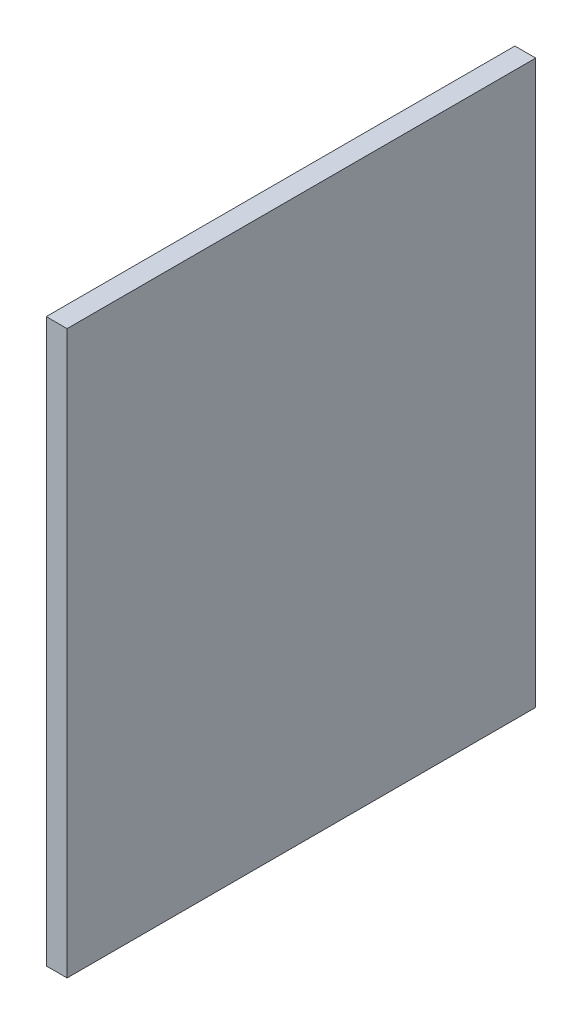
ISO-10303-21;
HEADER;
FILE_DESCRIPTION(('STEP AP214'),'2;1');
FILE_NAME('part.step','',(''),(''),'','','');
FILE_SCHEMA(('AUTOMOTIVE_DESIGN { 1 0 10303 214 1 1 1 1 }'));
ENDSEC;
DATA;
#1=APPLICATION_CONTEXT('core data for automotive mechanical design processes');
#2=APPLICATION_PROTOCOL_DEFINITION('international standard','automotive_design',2000,#1);
#3=PRODUCT_CONTEXT('',#1,'mechanical');
#4=PRODUCT('Part','Part','',(#3));
#5=PRODUCT_RELATED_PRODUCT_CATEGORY('part','',(#4));
#6=PRODUCT_DEFINITION_FORMATION('','',#4);
#7=PRODUCT_DEFINITION_CONTEXT('part definition',#1,'design');
#8=PRODUCT_DEFINITION('design','',#6,#7);
#9=PRODUCT_DEFINITION_SHAPE('','',#8);
#10=(LENGTH_UNIT() NAMED_UNIT(*) SI_UNIT(.MILLI.,.METRE.));
#11=(NAMED_UNIT(*) PLANE_ANGLE_UNIT() SI_UNIT($,.RADIAN.));
#12=(NAMED_UNIT(*) SI_UNIT($,.STERADIAN.) SOLID_ANGLE_UNIT());
#13=UNCERTAINTY_MEASURE_WITH_UNIT(LENGTH_MEASURE(1.E-05),#10,'distance_accuracy_value','');
#14=(GEOMETRIC_REPRESENTATION_CONTEXT(3) GLOBAL_UNCERTAINTY_ASSIGNED_CONTEXT((#13)) GLOBAL_UNIT_ASSIGNED_CONTEXT((#10,
#11,#12)) REPRESENTATION_CONTEXT('',''));
#15=CARTESIAN_POINT('',(0.,0.,0.));
#16=DIRECTION('',(0.,0.,1.));
#17=DIRECTION('',(1.,0.,0.));
#18=AXIS2_PLACEMENT_3D('',#15,#16,#17);
#19=CARTESIAN_POINT('',(6.,81.,-67.5));
#20=DIRECTION('',(0.,0.,1.));
#21=DIRECTION('',(0.,-1.,0.));
#22=AXIS2_PLACEMENT_3D('',#19,#20,#21);
#23=PLANE('',#22);
#24=DIRECTION('',(0.,1.,0.));
#25=VECTOR('',#24,1.);
#26=CARTESIAN_POINT('',(0.,81.,-67.5));
#27=LINE('',#26,#25);
#28=CARTESIAN_POINT('',(0.,-81.,-67.5));
#29=VERTEX_POINT('',#28);
#30=CARTESIAN_POINT('',(0.,81.,-67.5));
#31=VERTEX_POINT('',#30);
#32=EDGE_CURVE('E96',#29,#31,#27,.T.);
#33=ORIENTED_EDGE('',*,*,#32,.T.);
#34=DIRECTION('',(-1.,0.,0.));
#35=VECTOR('',#34,1.);
#36=CARTESIAN_POINT('',(6.,81.,-67.5));
#37=LINE('',#36,#35);
#38=CARTESIAN_POINT('',(6.,81.,-67.5));
#39=VERTEX_POINT('',#38);
#40=EDGE_CURVE('E11',#39,#31,#37,.T.);
#41=ORIENTED_EDGE('',*,*,#40,.F.);
#42=DIRECTION('',(0.,1.,0.));
#43=VECTOR('',#42,1.);
#44=CARTESIAN_POINT('',(6.,81.,-67.5));
#45=LINE('',#44,#43);
#46=CARTESIAN_POINT('',(6.,-81.,-67.5));
#47=VERTEX_POINT('',#46);
#48=EDGE_CURVE('E84',#47,#39,#45,.T.);
#49=ORIENTED_EDGE('',*,*,#48,.F.);
#50=DIRECTION('',(-1.,0.,0.));
#51=VECTOR('',#50,1.);
#52=CARTESIAN_POINT('',(6.,-81.,-67.5));
#53=LINE('',#52,#51);
#54=EDGE_CURVE('E92',#47,#29,#53,.T.);
#55=ORIENTED_EDGE('',*,*,#54,.T.);
#56=EDGE_LOOP('',(#33,#41,#49,#55));
#57=FACE_BOUND('',#56,.T.);
#58=ADVANCED_FACE('F33',(#57),#23,.F.);
#59=CARTESIAN_POINT('',(6.,81.,67.5));
#60=DIRECTION('',(0.,-1.,0.));
#61=DIRECTION('',(0.,0.,-1.));
#62=AXIS2_PLACEMENT_3D('',#59,#60,#61);
#63=PLANE('',#62);
#64=DIRECTION('',(0.,0.,1.));
#65=VECTOR('',#64,1.);
#66=CARTESIAN_POINT('',(0.,81.,67.5));
#67=LINE('',#66,#65);
#68=CARTESIAN_POINT('',(0.,81.,67.5));
#69=VERTEX_POINT('',#68);
#70=EDGE_CURVE('E88',#31,#69,#67,.T.);
#71=ORIENTED_EDGE('',*,*,#70,.T.);
#72=DIRECTION('',(-1.,0.,0.));
#73=VECTOR('',#72,1.);
#74=CARTESIAN_POINT('',(6.,81.,67.5));
#75=LINE('',#74,#73);
#76=CARTESIAN_POINT('',(6.,81.,67.5));
#77=VERTEX_POINT('',#76);
#78=EDGE_CURVE('E41',#77,#69,#75,.T.);
#79=ORIENTED_EDGE('',*,*,#78,.F.);
#80=DIRECTION('',(0.,0.,1.));
#81=VECTOR('',#80,1.);
#82=CARTESIAN_POINT('',(6.,81.,67.5));
#83=LINE('',#82,#81);
#84=EDGE_CURVE('E79',#39,#77,#83,.T.);
#85=ORIENTED_EDGE('',*,*,#84,.F.);
#86=ORIENTED_EDGE('',*,*,#40,.T.);
#87=EDGE_LOOP('',(#71,#79,#85,#86));
#88=FACE_BOUND('',#87,.T.);
#89=ADVANCED_FACE('F87',(#88),#63,.F.);
#90=CARTESIAN_POINT('',(6.,81.,67.5));
#91=DIRECTION('',(0.,0.,-1.));
#92=DIRECTION('',(-1.,0.,0.));
#93=AXIS2_PLACEMENT_3D('',#90,#91,#92);
#94=PLANE('',#93);
#95=DIRECTION('',(0.,-1.,0.));
#96=VECTOR('',#95,1.);
#97=CARTESIAN_POINT('',(0.,81.,67.5));
#98=LINE('',#97,#96);
#99=CARTESIAN_POINT('',(0.,-81.,67.5));
#100=VERTEX_POINT('',#99);
#101=EDGE_CURVE('E66',#69,#100,#98,.T.);
#102=ORIENTED_EDGE('',*,*,#101,.T.);
#103=DIRECTION('',(-1.,0.,0.));
#104=VECTOR('',#103,1.);
#105=CARTESIAN_POINT('',(6.,-81.,67.5));
#106=LINE('',#105,#104);
#107=CARTESIAN_POINT('',(6.,-81.,67.5));
#108=VERTEX_POINT('',#107);
#109=EDGE_CURVE('E89',#108,#100,#106,.T.);
#110=ORIENTED_EDGE('',*,*,#109,.F.);
#111=DIRECTION('',(0.,-1.,0.));
#112=VECTOR('',#111,1.);
#113=CARTESIAN_POINT('',(6.,81.,67.5));
#114=LINE('',#113,#112);
#115=EDGE_CURVE('E82',#77,#108,#114,.T.);
#116=ORIENTED_EDGE('',*,*,#115,.F.);
#117=ORIENTED_EDGE('',*,*,#78,.T.);
#118=EDGE_LOOP('',(#102,#110,#116,#117));
#119=FACE_BOUND('',#118,.T.);
#120=ADVANCED_FACE('F90',(#119),#94,.F.);
#121=CARTESIAN_POINT('',(6.,-81.,67.5));
#122=DIRECTION('',(0.,1.,0.));
#123=DIRECTION('',(0.,0.,1.));
#124=AXIS2_PLACEMENT_3D('',#121,#122,#123);
#125=PLANE('',#124);
#126=DIRECTION('',(0.,0.,-1.));
#127=VECTOR('',#126,1.);
#128=CARTESIAN_POINT('',(0.,-81.,67.5));
#129=LINE('',#128,#127);
#130=EDGE_CURVE('E72',#100,#29,#129,.T.);
#131=ORIENTED_EDGE('',*,*,#130,.T.);
#132=ORIENTED_EDGE('',*,*,#54,.F.);
#133=DIRECTION('',(0.,0.,-1.));
#134=VECTOR('',#133,1.);
#135=CARTESIAN_POINT('',(6.,-81.,67.5));
#136=LINE('',#135,#134);
#137=EDGE_CURVE('E49',#108,#47,#136,.T.);
#138=ORIENTED_EDGE('',*,*,#137,.F.);
#139=ORIENTED_EDGE('',*,*,#109,.T.);
#140=EDGE_LOOP('',(#131,#132,#138,#139));
#141=FACE_BOUND('',#140,.T.);
#142=ADVANCED_FACE('F103',(#141),#125,.F.);
#143=CARTESIAN_POINT('',(6.,0.,0.));
#144=DIRECTION('',(1.,0.,0.));
#145=DIRECTION('',(0.,0.,-1.));
#146=AXIS2_PLACEMENT_3D('',#143,#144,#145);
#147=PLANE('',#146);
#148=ORIENTED_EDGE('',*,*,#48,.T.);
#149=ORIENTED_EDGE('',*,*,#84,.T.);
#150=ORIENTED_EDGE('',*,*,#115,.T.);
#151=ORIENTED_EDGE('',*,*,#137,.T.);
#152=EDGE_LOOP('',(#148,#149,#150,#151));
#153=FACE_BOUND('',#152,.T.);
#154=ADVANCED_FACE('F80',(#153),#147,.T.);
#155=CARTESIAN_POINT('',(0.,0.,0.));
#156=DIRECTION('',(1.,0.,0.));
#157=DIRECTION('',(0.,0.,-1.));
#158=AXIS2_PLACEMENT_3D('',#155,#156,#157);
#159=PLANE('',#158);
#160=ORIENTED_EDGE('',*,*,#32,.F.);
#161=ORIENTED_EDGE('',*,*,#130,.F.);
#162=ORIENTED_EDGE('',*,*,#101,.F.);
#163=ORIENTED_EDGE('',*,*,#70,.F.);
#164=EDGE_LOOP('',(#160,#161,#162,#163));
#165=FACE_BOUND('',#164,.T.);
#166=ADVANCED_FACE('F106',(#165),#159,.F.);
#167=CLOSED_SHELL('',(#58,#89,#120,#142,#154,#166));
#168=MANIFOLD_SOLID_BREP('B2',#167);
#169=ADVANCED_BREP_SHAPE_REPRESENTATION('',(#18,#168),#14);
#170=SHAPE_DEFINITION_REPRESENTATION(#9,#169);
ENDSEC;
END-ISO-10303-21;
